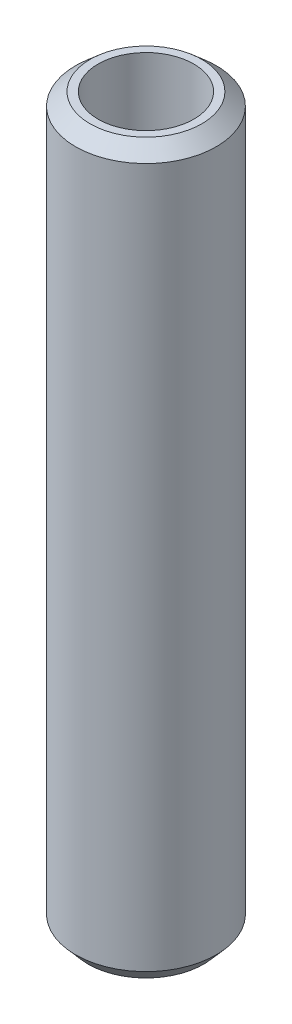
ISO-10303-21;
HEADER;
FILE_DESCRIPTION(('STEP AP214'),'2;1');
FILE_NAME('part.step','',(''),(''),'','','');
FILE_SCHEMA(('AUTOMOTIVE_DESIGN { 1 0 10303 214 1 1 1 1 }'));
ENDSEC;
DATA;
#1=APPLICATION_CONTEXT('core data for automotive mechanical design processes');
#2=APPLICATION_PROTOCOL_DEFINITION('international standard','automotive_design',2000,#1);
#3=PRODUCT_CONTEXT('',#1,'mechanical');
#4=PRODUCT('Part','Part','',(#3));
#5=PRODUCT_RELATED_PRODUCT_CATEGORY('part','',(#4));
#6=PRODUCT_DEFINITION_FORMATION('','',#4);
#7=PRODUCT_DEFINITION_CONTEXT('part definition',#1,'design');
#8=PRODUCT_DEFINITION('design','',#6,#7);
#9=PRODUCT_DEFINITION_SHAPE('','',#8);
#10=(LENGTH_UNIT() NAMED_UNIT(*) SI_UNIT(.MILLI.,.METRE.));
#11=(NAMED_UNIT(*) PLANE_ANGLE_UNIT() SI_UNIT($,.RADIAN.));
#12=(NAMED_UNIT(*) SI_UNIT($,.STERADIAN.) SOLID_ANGLE_UNIT());
#13=UNCERTAINTY_MEASURE_WITH_UNIT(LENGTH_MEASURE(1.E-05),#10,'distance_accuracy_value','');
#14=(GEOMETRIC_REPRESENTATION_CONTEXT(3) GLOBAL_UNCERTAINTY_ASSIGNED_CONTEXT((#13)) GLOBAL_UNIT_ASSIGNED_CONTEXT((#10,
#11,#12)) REPRESENTATION_CONTEXT('',''));
#15=CARTESIAN_POINT('',(0.,0.,0.));
#16=DIRECTION('',(0.,0.,1.));
#17=DIRECTION('',(1.,0.,0.));
#18=AXIS2_PLACEMENT_3D('',#15,#16,#17);
#19=CARTESIAN_POINT('',(0.,284.217432379433,0.));
#20=DIRECTION('',(0.,-1.,0.));
#21=DIRECTION('',(0.,0.,-1.));
#22=AXIS2_PLACEMENT_3D('',#19,#20,#21);
#23=CYLINDRICAL_SURFACE('',#22,27.5);
#24=CARTESIAN_POINT('',(0.,279.282003669021,0.));
#25=DIRECTION('',(0.,1.,0.));
#26=DIRECTION('',(0.,0.,1.));
#27=AXIS2_PLACEMENT_3D('',#24,#25,#26);
#28=CIRCLE('',#27,27.5);
#29=CARTESIAN_POINT('',(0.,279.282003669021,27.5));
#30=VERTEX_POINT('',#29);
#31=EDGE_CURVE('E50',#30,#30,#28,.F.);
#32=ORIENTED_EDGE('',*,*,#31,.T.);
#33=EDGE_LOOP('',(#32));
#34=FACE_BOUND('',#33,.T.);
#35=CARTESIAN_POINT('',(0.,5.66069136138109,0.));
#36=DIRECTION('',(0.,1.,0.));
#37=DIRECTION('',(0.,0.,1.));
#38=AXIS2_PLACEMENT_3D('',#35,#36,#37);
#39=CIRCLE('',#38,27.5);
#40=CARTESIAN_POINT('',(0.,5.66069136138109,27.5));
#41=VERTEX_POINT('',#40);
#42=EDGE_CURVE('E51',#41,#41,#39,.T.);
#43=ORIENTED_EDGE('',*,*,#42,.T.);
#44=EDGE_LOOP('',(#43));
#45=FACE_BOUND('',#44,.T.);
#46=ADVANCED_FACE('F39',(#34,#45),#23,.T.);
#47=CARTESIAN_POINT('',(0.,284.217432379433,0.));
#48=DIRECTION('',(0.,1.,0.));
#49=DIRECTION('',(0.,0.,1.));
#50=AXIS2_PLACEMENT_3D('',#47,#48,#49);
#51=PLANE('',#50);
#52=CARTESIAN_POINT('',(0.,284.217432379433,0.));
#53=DIRECTION('',(0.,1.,0.));
#54=DIRECTION('',(0.,0.,1.));
#55=AXIS2_PLACEMENT_3D('',#52,#53,#54);
#56=CIRCLE('',#55,21.8393086386189);
#57=CARTESIAN_POINT('',(0.,284.217432379433,21.8393086386189));
#58=VERTEX_POINT('',#57);
#59=EDGE_CURVE('E54',#58,#58,#56,.T.);
#60=ORIENTED_EDGE('',*,*,#59,.T.);
#61=EDGE_LOOP('',(#60));
#62=FACE_BOUND('',#61,.T.);
#63=CARTESIAN_POINT('',(0.,284.217432379433,0.));
#64=DIRECTION('',(0.,1.,0.));
#65=DIRECTION('',(0.,0.,1.));
#66=AXIS2_PLACEMENT_3D('',#63,#64,#65);
#67=CIRCLE('',#66,18.7161852213225);
#68=CARTESIAN_POINT('',(0.,284.217432379433,18.7161852213225));
#69=VERTEX_POINT('',#68);
#70=EDGE_CURVE('E58',#69,#69,#67,.T.);
#71=ORIENTED_EDGE('',*,*,#70,.F.);
#72=EDGE_LOOP('',(#71));
#73=FACE_BOUND('',#72,.T.);
#74=ADVANCED_FACE('F69',(#62,#73),#51,.T.);
#75=CARTESIAN_POINT('',(0.,0.,0.));
#76=DIRECTION('',(0.,1.,0.));
#77=DIRECTION('',(0.,0.,1.));
#78=AXIS2_PLACEMENT_3D('',#75,#76,#77);
#79=PLANE('',#78);
#80=CARTESIAN_POINT('',(0.,0.,0.));
#81=DIRECTION('',(0.,1.,0.));
#82=DIRECTION('',(0.,0.,1.));
#83=AXIS2_PLACEMENT_3D('',#80,#81,#82);
#84=CIRCLE('',#83,22.5645712895879);
#85=CARTESIAN_POINT('',(0.,0.,22.5645712895879));
#86=VERTEX_POINT('',#85);
#87=EDGE_CURVE('E10',#86,#86,#84,.F.);
#88=ORIENTED_EDGE('',*,*,#87,.T.);
#89=EDGE_LOOP('',(#88));
#90=FACE_BOUND('',#89,.T.);
#91=CARTESIAN_POINT('',(0.,0.,0.));
#92=DIRECTION('',(0.,1.,0.));
#93=DIRECTION('',(0.,0.,1.));
#94=AXIS2_PLACEMENT_3D('',#91,#92,#93);
#95=CIRCLE('',#94,18.7161852213225);
#96=CARTESIAN_POINT('',(0.,0.,18.7161852213225));
#97=VERTEX_POINT('',#96);
#98=EDGE_CURVE('E63',#97,#97,#95,.T.);
#99=ORIENTED_EDGE('',*,*,#98,.T.);
#100=EDGE_LOOP('',(#99));
#101=FACE_BOUND('',#100,.T.);
#102=ADVANCED_FACE('F75',(#90,#101),#79,.F.);
#103=CARTESIAN_POINT('',(0.,284.217432379433,0.));
#104=DIRECTION('',(0.,-1.,0.));
#105=DIRECTION('',(0.,0.,-1.));
#106=AXIS2_PLACEMENT_3D('',#103,#104,#105);
#107=CYLINDRICAL_SURFACE('',#106,18.7161852213225);
#108=ORIENTED_EDGE('',*,*,#70,.T.);
#109=EDGE_LOOP('',(#108));
#110=FACE_BOUND('',#109,.T.);
#111=ORIENTED_EDGE('',*,*,#98,.F.);
#112=EDGE_LOOP('',(#111));
#113=FACE_BOUND('',#112,.T.);
#114=ADVANCED_FACE('F70',(#110,#113),#107,.F.);
#115=CARTESIAN_POINT('',(0.,284.217432379433,0.));
#116=DIRECTION('',(0.,-1.,0.));
#117=DIRECTION('',(0.,0.,-1.));
#118=AXIS2_PLACEMENT_3D('',#115,#116,#117);
#119=CONICAL_SURFACE('',#118,21.8393086386189,0.853737634231558);
#120=ORIENTED_EDGE('',*,*,#31,.F.);
#121=EDGE_LOOP('',(#120));
#122=FACE_BOUND('',#121,.T.);
#123=ORIENTED_EDGE('',*,*,#59,.F.);
#124=EDGE_LOOP('',(#123));
#125=FACE_BOUND('',#124,.T.);
#126=ADVANCED_FACE('F81',(#122,#125),#119,.T.);
#127=CARTESIAN_POINT('',(0.,5.66069136138109,0.));
#128=DIRECTION('',(0.,1.,0.));
#129=DIRECTION('',(0.,0.,1.));
#130=AXIS2_PLACEMENT_3D('',#127,#128,#129);
#131=CONICAL_SURFACE('',#130,27.5,0.717058692563345);
#132=ORIENTED_EDGE('',*,*,#87,.F.);
#133=EDGE_LOOP('',(#132));
#134=FACE_BOUND('',#133,.T.);
#135=ORIENTED_EDGE('',*,*,#42,.F.);
#136=EDGE_LOOP('',(#135));
#137=FACE_BOUND('',#136,.T.);
#138=ADVANCED_FACE('F45',(#134,#137),#131,.T.);
#139=CLOSED_SHELL('',(#46,#74,#102,#114,#126,#138));
#140=MANIFOLD_SOLID_BREP('B2',#139);
#141=ADVANCED_BREP_SHAPE_REPRESENTATION('',(#18,#140),#14);
#142=SHAPE_DEFINITION_REPRESENTATION(#9,#141);
ENDSEC;
END-ISO-10303-21;
